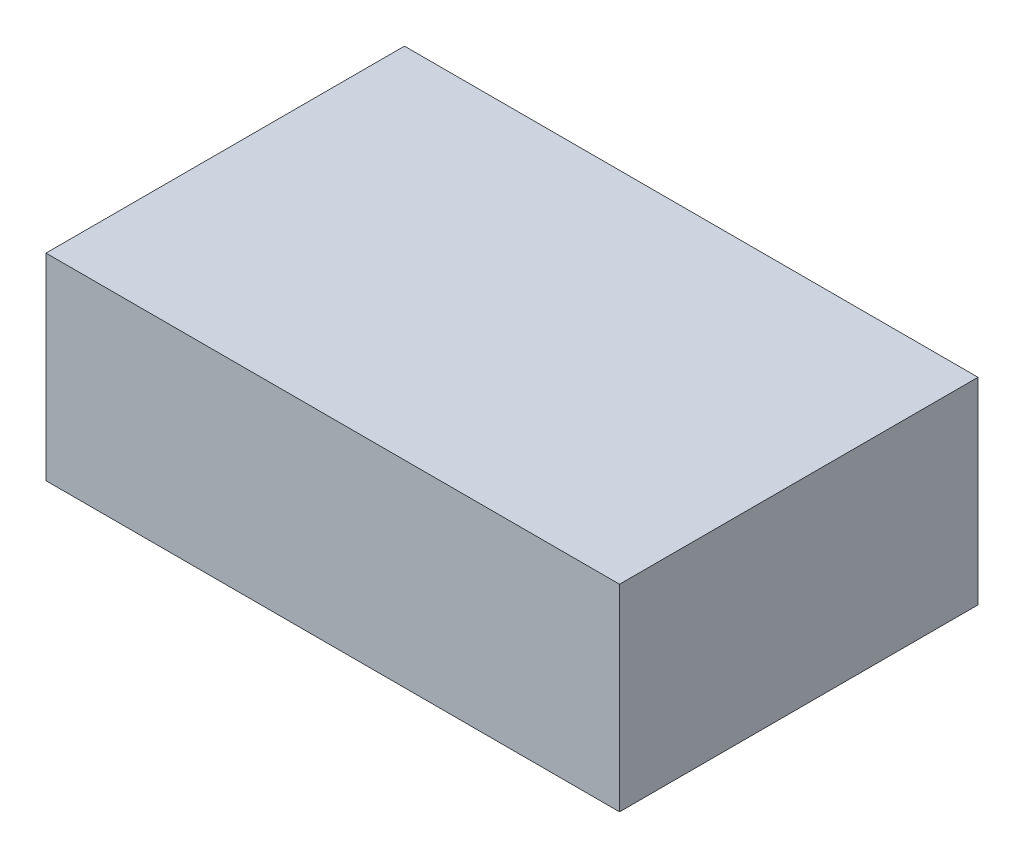
ISO-10303-21;
HEADER;
FILE_DESCRIPTION(('STEP AP214'),'2;1');
FILE_NAME('part.step','',(''),(''),'','','');
FILE_SCHEMA(('AUTOMOTIVE_DESIGN { 1 0 10303 214 1 1 1 1 }'));
ENDSEC;
DATA;
#1=APPLICATION_CONTEXT('core data for automotive mechanical design processes');
#2=APPLICATION_PROTOCOL_DEFINITION('international standard','automotive_design',2000,#1);
#3=PRODUCT_CONTEXT('',#1,'mechanical');
#4=PRODUCT('Part','Part','',(#3));
#5=PRODUCT_RELATED_PRODUCT_CATEGORY('part','',(#4));
#6=PRODUCT_DEFINITION_FORMATION('','',#4);
#7=PRODUCT_DEFINITION_CONTEXT('part definition',#1,'design');
#8=PRODUCT_DEFINITION('design','',#6,#7);
#9=PRODUCT_DEFINITION_SHAPE('','',#8);
#10=(LENGTH_UNIT() NAMED_UNIT(*) SI_UNIT(.MILLI.,.METRE.));
#11=(NAMED_UNIT(*) PLANE_ANGLE_UNIT() SI_UNIT($,.RADIAN.));
#12=(NAMED_UNIT(*) SI_UNIT($,.STERADIAN.) SOLID_ANGLE_UNIT());
#13=UNCERTAINTY_MEASURE_WITH_UNIT(LENGTH_MEASURE(1.E-05),#10,'distance_accuracy_value','');
#14=(GEOMETRIC_REPRESENTATION_CONTEXT(3) GLOBAL_UNCERTAINTY_ASSIGNED_CONTEXT((#13)) GLOBAL_UNIT_ASSIGNED_CONTEXT((#10,
#11,#12)) REPRESENTATION_CONTEXT('',''));
#15=CARTESIAN_POINT('',(0.,0.,0.));
#16=DIRECTION('',(0.,0.,1.));
#17=DIRECTION('',(1.,0.,0.));
#18=AXIS2_PLACEMENT_3D('',#15,#16,#17);
#19=CARTESIAN_POINT('',(16.00000102,5.49999916,0.));
#20=DIRECTION('',(0.,-1.,0.));
#21=DIRECTION('',(0.,0.,-1.));
#22=AXIS2_PLACEMENT_3D('',#19,#20,#21);
#23=PLANE('',#22);
#24=DIRECTION('',(0.,0.,-1.));
#25=VECTOR('',#24,1.);
#26=CARTESIAN_POINT('',(-16.00000102,5.49999916,0.));
#27=LINE('',#26,#25);
#28=CARTESIAN_POINT('',(-16.00000102,5.49999916,0.));
#29=VERTEX_POINT('',#28);
#30=CARTESIAN_POINT('',(-16.00000102,5.49999916,20.00000064));
#31=VERTEX_POINT('',#30);
#32=EDGE_CURVE('E20',#29,#31,#27,.F.);
#33=ORIENTED_EDGE('',*,*,#32,.T.);
#34=DIRECTION('',(-1.,0.,0.));
#35=VECTOR('',#34,1.);
#36=CARTESIAN_POINT('',(-16.00000102,5.49999916,20.00000064));
#37=LINE('',#36,#35);
#38=CARTESIAN_POINT('',(16.00000102,5.49999916,20.00000064));
#39=VERTEX_POINT('',#38);
#40=EDGE_CURVE('E55',#31,#39,#37,.F.);
#41=ORIENTED_EDGE('',*,*,#40,.T.);
#42=DIRECTION('',(0.,0.,1.));
#43=VECTOR('',#42,1.);
#44=CARTESIAN_POINT('',(16.00000102,5.49999916,0.));
#45=LINE('',#44,#43);
#46=CARTESIAN_POINT('',(16.00000102,5.49999916,0.));
#47=VERTEX_POINT('',#46);
#48=EDGE_CURVE('E76',#39,#47,#45,.F.);
#49=ORIENTED_EDGE('',*,*,#48,.T.);
#50=DIRECTION('',(-1.,0.,0.));
#51=VECTOR('',#50,1.);
#52=CARTESIAN_POINT('',(-16.00000102,5.49999916,0.));
#53=LINE('',#52,#51);
#54=EDGE_CURVE('E58',#29,#47,#53,.F.);
#55=ORIENTED_EDGE('',*,*,#54,.F.);
#56=EDGE_LOOP('',(#33,#41,#49,#55));
#57=FACE_BOUND('',#56,.T.);
#58=ADVANCED_FACE('F17',(#57),#23,.F.);
#59=CARTESIAN_POINT('',(-16.00000102,5.49999916,0.));
#60=DIRECTION('',(1.,0.,0.));
#61=DIRECTION('',(0.,0.,-1.));
#62=AXIS2_PLACEMENT_3D('',#59,#60,#61);
#63=PLANE('',#62);
#64=DIRECTION('',(0.,0.,1.));
#65=VECTOR('',#64,1.);
#66=CARTESIAN_POINT('',(-16.00000102,-5.49999916,0.));
#67=LINE('',#66,#65);
#68=CARTESIAN_POINT('',(-16.00000102,-5.49999916,0.));
#69=VERTEX_POINT('',#68);
#70=CARTESIAN_POINT('',(-16.00000102,-5.49999916,20.00000064));
#71=VERTEX_POINT('',#70);
#72=EDGE_CURVE('E73',#69,#71,#67,.T.);
#73=ORIENTED_EDGE('',*,*,#72,.T.);
#74=DIRECTION('',(0.,1.,0.));
#75=VECTOR('',#74,1.);
#76=CARTESIAN_POINT('',(-16.00000102,-5.49999916,20.00000064));
#77=LINE('',#76,#75);
#78=EDGE_CURVE('E63',#71,#31,#77,.T.);
#79=ORIENTED_EDGE('',*,*,#78,.T.);
#80=ORIENTED_EDGE('',*,*,#32,.F.);
#81=DIRECTION('',(0.,1.,0.));
#82=VECTOR('',#81,1.);
#83=CARTESIAN_POINT('',(-16.00000102,-5.49999916,0.));
#84=LINE('',#83,#82);
#85=EDGE_CURVE('E78',#69,#29,#84,.T.);
#86=ORIENTED_EDGE('',*,*,#85,.F.);
#87=EDGE_LOOP('',(#73,#79,#80,#86));
#88=FACE_BOUND('',#87,.T.);
#89=ADVANCED_FACE('F72',(#88),#63,.F.);
#90=CARTESIAN_POINT('',(-16.00000102,-5.49999916,20.00000064));
#91=DIRECTION('',(0.,0.,-1.));
#92=DIRECTION('',(-1.,0.,0.));
#93=AXIS2_PLACEMENT_3D('',#90,#91,#92);
#94=PLANE('',#93);
#95=DIRECTION('',(0.,1.,0.));
#96=VECTOR('',#95,1.);
#97=CARTESIAN_POINT('',(16.00000102,-5.49999916,20.00000064));
#98=LINE('',#97,#96);
#99=CARTESIAN_POINT('',(16.00000102,-5.49999916,20.00000064));
#100=VERTEX_POINT('',#99);
#101=EDGE_CURVE('E69',#100,#39,#98,.T.);
#102=ORIENTED_EDGE('',*,*,#101,.T.);
#103=ORIENTED_EDGE('',*,*,#40,.F.);
#104=ORIENTED_EDGE('',*,*,#78,.F.);
#105=DIRECTION('',(1.,0.,0.));
#106=VECTOR('',#105,1.);
#107=CARTESIAN_POINT('',(-16.00000102,-5.49999916,20.00000064));
#108=LINE('',#107,#106);
#109=EDGE_CURVE('E83',#71,#100,#108,.T.);
#110=ORIENTED_EDGE('',*,*,#109,.T.);
#111=EDGE_LOOP('',(#102,#103,#104,#110));
#112=FACE_BOUND('',#111,.T.);
#113=ADVANCED_FACE('F66',(#112),#94,.F.);
#114=CARTESIAN_POINT('',(16.00000102,-5.49999916,0.));
#115=DIRECTION('',(-1.,0.,0.));
#116=DIRECTION('',(0.,0.,1.));
#117=AXIS2_PLACEMENT_3D('',#114,#115,#116);
#118=PLANE('',#117);
#119=ORIENTED_EDGE('',*,*,#48,.F.);
#120=ORIENTED_EDGE('',*,*,#101,.F.);
#121=DIRECTION('',(0.,0.,1.));
#122=VECTOR('',#121,1.);
#123=CARTESIAN_POINT('',(16.00000102,-5.49999916,0.));
#124=LINE('',#123,#122);
#125=CARTESIAN_POINT('',(16.00000102,-5.49999916,0.));
#126=VERTEX_POINT('',#125);
#127=EDGE_CURVE('E26',#100,#126,#124,.F.);
#128=ORIENTED_EDGE('',*,*,#127,.T.);
#129=DIRECTION('',(0.,1.,0.));
#130=VECTOR('',#129,1.);
#131=CARTESIAN_POINT('',(16.00000102,-5.49999916,0.));
#132=LINE('',#131,#130);
#133=EDGE_CURVE('E34',#47,#126,#132,.F.);
#134=ORIENTED_EDGE('',*,*,#133,.F.);
#135=EDGE_LOOP('',(#119,#120,#128,#134));
#136=FACE_BOUND('',#135,.T.);
#137=ADVANCED_FACE('F88',(#136),#118,.F.);
#138=CARTESIAN_POINT('',(-16.00000102,-5.49999916,0.));
#139=DIRECTION('',(0.,0.,-1.));
#140=DIRECTION('',(-1.,0.,0.));
#141=AXIS2_PLACEMENT_3D('',#138,#139,#140);
#142=PLANE('',#141);
#143=ORIENTED_EDGE('',*,*,#133,.T.);
#144=DIRECTION('',(1.,0.,0.));
#145=VECTOR('',#144,1.);
#146=CARTESIAN_POINT('',(-16.00000102,-5.49999916,0.));
#147=LINE('',#146,#145);
#148=EDGE_CURVE('E11',#126,#69,#147,.F.);
#149=ORIENTED_EDGE('',*,*,#148,.T.);
#150=ORIENTED_EDGE('',*,*,#85,.T.);
#151=ORIENTED_EDGE('',*,*,#54,.T.);
#152=EDGE_LOOP('',(#143,#149,#150,#151));
#153=FACE_BOUND('',#152,.T.);
#154=ADVANCED_FACE('F91',(#153),#142,.T.);
#155=CARTESIAN_POINT('',(-16.00000102,-5.49999916,0.));
#156=DIRECTION('',(0.,1.,0.));
#157=DIRECTION('',(0.,0.,1.));
#158=AXIS2_PLACEMENT_3D('',#155,#156,#157);
#159=PLANE('',#158);
#160=ORIENTED_EDGE('',*,*,#127,.F.);
#161=ORIENTED_EDGE('',*,*,#109,.F.);
#162=ORIENTED_EDGE('',*,*,#72,.F.);
#163=ORIENTED_EDGE('',*,*,#148,.F.);
#164=EDGE_LOOP('',(#160,#161,#162,#163));
#165=FACE_BOUND('',#164,.T.);
#166=ADVANCED_FACE('F90',(#165),#159,.F.);
#167=CLOSED_SHELL('',(#58,#89,#113,#137,#154,#166));
#168=MANIFOLD_SOLID_BREP('B1',#167);
#169=ADVANCED_BREP_SHAPE_REPRESENTATION('',(#18,#168),#14);
#170=SHAPE_DEFINITION_REPRESENTATION(#9,#169);
ENDSEC;
END-ISO-10303-21;
